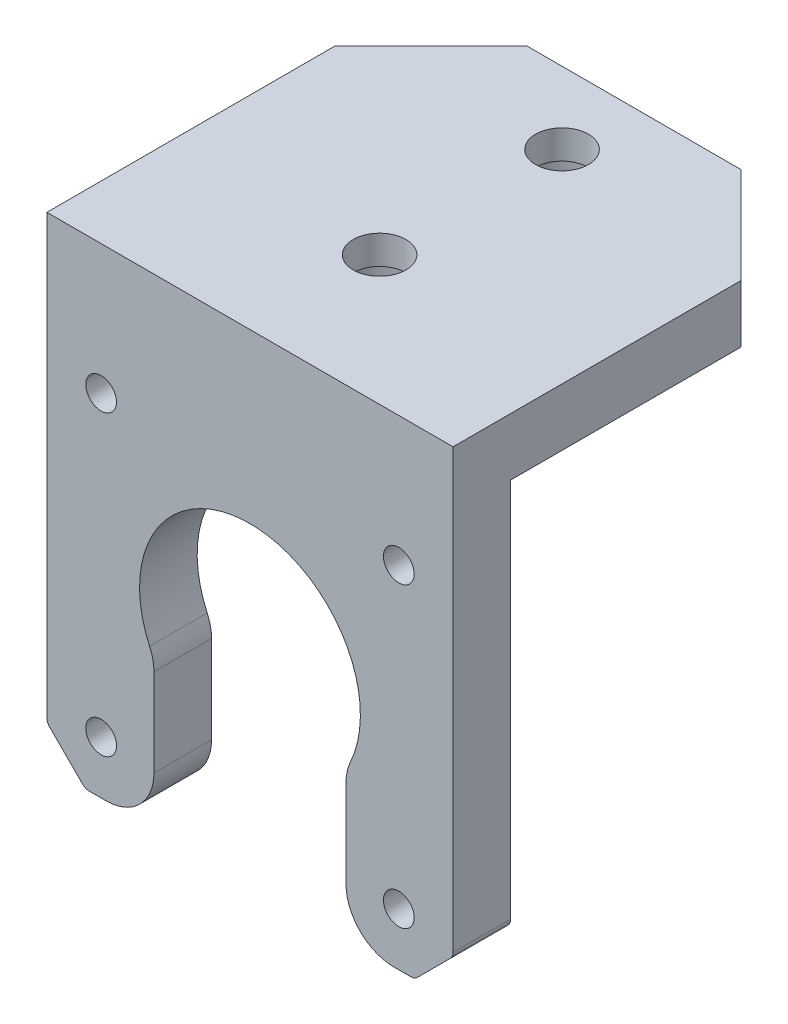
ISO-10303-21;
HEADER;
FILE_DESCRIPTION(('STEP AP214'),'2;1');
FILE_NAME('part.step','',(''),(''),'','','');
FILE_SCHEMA(('AUTOMOTIVE_DESIGN { 1 0 10303 214 1 1 1 1 }'));
ENDSEC;
DATA;
#1=APPLICATION_CONTEXT('core data for automotive mechanical design processes');
#2=APPLICATION_PROTOCOL_DEFINITION('international standard','automotive_design',2000,#1);
#3=PRODUCT_CONTEXT('',#1,'mechanical');
#4=PRODUCT('Part','Part','',(#3));
#5=PRODUCT_RELATED_PRODUCT_CATEGORY('part','',(#4));
#6=PRODUCT_DEFINITION_FORMATION('','',#4);
#7=PRODUCT_DEFINITION_CONTEXT('part definition',#1,'design');
#8=PRODUCT_DEFINITION('design','',#6,#7);
#9=PRODUCT_DEFINITION_SHAPE('','',#8);
#10=(LENGTH_UNIT() NAMED_UNIT(*) SI_UNIT(.MILLI.,.METRE.));
#11=(NAMED_UNIT(*) PLANE_ANGLE_UNIT() SI_UNIT($,.RADIAN.));
#12=(NAMED_UNIT(*) SI_UNIT($,.STERADIAN.) SOLID_ANGLE_UNIT());
#13=UNCERTAINTY_MEASURE_WITH_UNIT(LENGTH_MEASURE(1.E-05),#10,'distance_accuracy_value','');
#14=(GEOMETRIC_REPRESENTATION_CONTEXT(3) GLOBAL_UNCERTAINTY_ASSIGNED_CONTEXT((#13)) GLOBAL_UNIT_ASSIGNED_CONTEXT((#10,
#11,#12)) REPRESENTATION_CONTEXT('',''));
#15=CARTESIAN_POINT('',(0.,0.,0.));
#16=DIRECTION('',(0.,0.,1.));
#17=DIRECTION('',(1.,0.,0.));
#18=AXIS2_PLACEMENT_3D('',#15,#16,#17);
#19=CARTESIAN_POINT('',(-16.7357864376269,-49.,-4.99999999999998));
#20=DIRECTION('',(0.,0.,1.));
#21=DIRECTION('',(1.,0.,0.));
#22=AXIS2_PLACEMENT_3D('',#19,#20,#21);
#23=CYLINDRICAL_SURFACE('',#22,1.);
#24=CARTESIAN_POINT('',(-16.7357864376269,-49.,-5.99999999999998));
#25=DIRECTION('',(0.,0.,1.));
#26=DIRECTION('',(1.,0.,0.));
#27=AXIS2_PLACEMENT_3D('',#24,#25,#26);
#28=CIRCLE('',#27,1.);
#29=CARTESIAN_POINT('',(-17.4428932188135,-49.7071067811866,-5.99999999999998));
#30=VERTEX_POINT('',#29);
#31=CARTESIAN_POINT('',(-16.7357864376269,-50.,-5.99999999999998));
#32=VERTEX_POINT('',#31);
#33=EDGE_CURVE('E170',#30,#32,#28,.T.);
#34=ORIENTED_EDGE('',*,*,#33,.T.);
#35=DIRECTION('',(0.,0.,-1.));
#36=VECTOR('',#35,1.);
#37=CARTESIAN_POINT('',(-16.7357864376269,-50.,0.));
#38=LINE('',#37,#36);
#39=CARTESIAN_POINT('',(-16.7357864376269,-50.,0.));
#40=VERTEX_POINT('',#39);
#41=EDGE_CURVE('E168',#40,#32,#38,.T.);
#42=ORIENTED_EDGE('',*,*,#41,.F.);
#43=CARTESIAN_POINT('',(-16.7357864376269,-49.,0.));
#44=DIRECTION('',(0.,0.,1.));
#45=DIRECTION('',(1.,0.,0.));
#46=AXIS2_PLACEMENT_3D('',#43,#44,#45);
#47=CIRCLE('',#46,1.);
#48=CARTESIAN_POINT('',(-17.4428932188135,-49.7071067811866,0.));
#49=VERTEX_POINT('',#48);
#50=EDGE_CURVE('E19',#40,#49,#47,.F.);
#51=ORIENTED_EDGE('',*,*,#50,.T.);
#52=DIRECTION('',(0.,0.,1.));
#53=VECTOR('',#52,1.);
#54=CARTESIAN_POINT('',(-17.4428932188135,-49.7071067811866,-9.99999999999998));
#55=LINE('',#54,#53);
#56=EDGE_CURVE('E165',#30,#49,#55,.T.);
#57=ORIENTED_EDGE('',*,*,#56,.F.);
#58=EDGE_LOOP('',(#34,#42,#51,#57));
#59=FACE_BOUND('',#58,.T.);
#60=ADVANCED_FACE('F16',(#59),#23,.T.);
#61=CARTESIAN_POINT('',(16.7357864376269,-49.,-4.99999999999998));
#62=DIRECTION('',(0.,0.,-1.));
#63=DIRECTION('',(-1.,0.,0.));
#64=AXIS2_PLACEMENT_3D('',#61,#62,#63);
#65=CYLINDRICAL_SURFACE('',#64,1.);
#66=CARTESIAN_POINT('',(16.7357864376269,-49.,0.));
#67=DIRECTION('',(0.,0.,-1.));
#68=DIRECTION('',(-1.,0.,0.));
#69=AXIS2_PLACEMENT_3D('',#66,#67,#68);
#70=CIRCLE('',#69,1.);
#71=CARTESIAN_POINT('',(17.4428932188135,-49.7071067811866,0.));
#72=VERTEX_POINT('',#71);
#73=CARTESIAN_POINT('',(16.7357864376269,-50.,0.));
#74=VERTEX_POINT('',#73);
#75=EDGE_CURVE('E417',#72,#74,#70,.T.);
#76=ORIENTED_EDGE('',*,*,#75,.T.);
#77=DIRECTION('',(0.,0.,-1.));
#78=VECTOR('',#77,1.);
#79=CARTESIAN_POINT('',(16.7357864376269,-50.,0.));
#80=LINE('',#79,#78);
#81=CARTESIAN_POINT('',(16.7357864376269,-50.,-5.99999999999998));
#82=VERTEX_POINT('',#81);
#83=EDGE_CURVE('E258',#82,#74,#80,.F.);
#84=ORIENTED_EDGE('',*,*,#83,.F.);
#85=CARTESIAN_POINT('',(16.7357864376269,-49.,-5.99999999999998));
#86=DIRECTION('',(0.,0.,-1.));
#87=DIRECTION('',(-1.,0.,0.));
#88=AXIS2_PLACEMENT_3D('',#85,#86,#87);
#89=CIRCLE('',#88,1.);
#90=CARTESIAN_POINT('',(17.4428932188135,-49.7071067811866,-5.99999999999998));
#91=VERTEX_POINT('',#90);
#92=EDGE_CURVE('E419',#82,#91,#89,.F.);
#93=ORIENTED_EDGE('',*,*,#92,.T.);
#94=DIRECTION('',(0.,0.,1.));
#95=VECTOR('',#94,1.);
#96=CARTESIAN_POINT('',(17.4428932188135,-49.7071067811866,-9.99999999999998));
#97=LINE('',#96,#95);
#98=EDGE_CURVE('E252',#72,#91,#97,.F.);
#99=ORIENTED_EDGE('',*,*,#98,.F.);
#100=EDGE_LOOP('',(#76,#84,#93,#99));
#101=FACE_BOUND('',#100,.T.);
#102=ADVANCED_FACE('F589',(#101),#65,.T.);
#103=CARTESIAN_POINT('',(0.,-6.00000000000002,-32.5));
#104=DIRECTION('',(0.,1.,0.));
#105=DIRECTION('',(0.,0.,1.));
#106=AXIS2_PLACEMENT_3D('',#103,#104,#105);
#107=CYLINDRICAL_SURFACE('',#106,4.75);
#108=CARTESIAN_POINT('',(0.,-3.00000000000002,-32.5));
#109=DIRECTION('',(0.,1.,0.));
#110=DIRECTION('',(0.,0.,1.));
#111=AXIS2_PLACEMENT_3D('',#108,#109,#110);
#112=CIRCLE('',#111,4.75);
#113=CARTESIAN_POINT('',(0.,-3.00000000000002,-27.75));
#114=VERTEX_POINT('',#113);
#115=EDGE_CURVE('E382',#114,#114,#112,.F.);
#116=ORIENTED_EDGE('',*,*,#115,.F.);
#117=EDGE_LOOP('',(#116));
#118=FACE_BOUND('',#117,.T.);
#119=CARTESIAN_POINT('',(0.,-6.00000000000002,-32.5));
#120=DIRECTION('',(0.,1.,0.));
#121=DIRECTION('',(0.,0.,1.));
#122=AXIS2_PLACEMENT_3D('',#119,#120,#121);
#123=CIRCLE('',#122,4.75);
#124=CARTESIAN_POINT('',(0.,-6.00000000000002,-27.75));
#125=VERTEX_POINT('',#124);
#126=EDGE_CURVE('E385',#125,#125,#123,.T.);
#127=ORIENTED_EDGE('',*,*,#126,.F.);
#128=EDGE_LOOP('',(#127));
#129=FACE_BOUND('',#128,.T.);
#130=ADVANCED_FACE('F586',(#118,#129),#107,.F.);
#131=CARTESIAN_POINT('',(0.,-6.00000000000001,-13.5));
#132=DIRECTION('',(0.,1.,0.));
#133=DIRECTION('',(0.,0.,1.));
#134=AXIS2_PLACEMENT_3D('',#131,#132,#133);
#135=CYLINDRICAL_SURFACE('',#134,4.75);
#136=CARTESIAN_POINT('',(0.,-3.00000000000001,-13.5));
#137=DIRECTION('',(0.,1.,0.));
#138=DIRECTION('',(0.,0.,1.));
#139=AXIS2_PLACEMENT_3D('',#136,#137,#138);
#140=CIRCLE('',#139,4.75);
#141=CARTESIAN_POINT('',(0.,-3.00000000000001,-8.75));
#142=VERTEX_POINT('',#141);
#143=EDGE_CURVE('E327',#142,#142,#140,.F.);
#144=ORIENTED_EDGE('',*,*,#143,.F.);
#145=EDGE_LOOP('',(#144));
#146=FACE_BOUND('',#145,.T.);
#147=CARTESIAN_POINT('',(0.,-6.00000000000001,-13.5));
#148=DIRECTION('',(0.,1.,0.));
#149=DIRECTION('',(0.,0.,1.));
#150=AXIS2_PLACEMENT_3D('',#147,#148,#149);
#151=CIRCLE('',#150,4.75);
#152=CARTESIAN_POINT('',(0.,-6.00000000000001,-8.75));
#153=VERTEX_POINT('',#152);
#154=EDGE_CURVE('E248',#153,#153,#151,.T.);
#155=ORIENTED_EDGE('',*,*,#154,.F.);
#156=EDGE_LOOP('',(#155));
#157=FACE_BOUND('',#156,.T.);
#158=ADVANCED_FACE('F583',(#146,#157),#135,.F.);
#159=CARTESIAN_POINT('',(-20.15,-45.5857864376269,-15.));
#160=DIRECTION('',(0.,0.,-1.));
#161=DIRECTION('',(-1.,0.,0.));
#162=AXIS2_PLACEMENT_3D('',#159,#160,#161);
#163=CYLINDRICAL_SURFACE('',#162,1.);
#164=CARTESIAN_POINT('',(-20.15,-45.5857864376269,0.));
#165=DIRECTION('',(0.,0.,-1.));
#166=DIRECTION('',(-1.,0.,0.));
#167=AXIS2_PLACEMENT_3D('',#164,#165,#166);
#168=CIRCLE('',#167,1.);
#169=CARTESIAN_POINT('',(-20.8571067811865,-46.2928932188135,0.));
#170=VERTEX_POINT('',#169);
#171=CARTESIAN_POINT('',(-21.15,-45.5857864376269,0.));
#172=VERTEX_POINT('',#171);
#173=EDGE_CURVE('E181',#170,#172,#168,.T.);
#174=ORIENTED_EDGE('',*,*,#173,.T.);
#175=DIRECTION('',(0.,0.,1.));
#176=VECTOR('',#175,1.);
#177=CARTESIAN_POINT('',(-21.15,-45.5857864376269,-20.));
#178=LINE('',#177,#176);
#179=CARTESIAN_POINT('',(-21.15,-45.5857864376269,-5.99999999999999));
#180=VERTEX_POINT('',#179);
#181=EDGE_CURVE('E277',#180,#172,#178,.T.);
#182=ORIENTED_EDGE('',*,*,#181,.F.);
#183=CARTESIAN_POINT('',(-20.15,-45.5857864376269,-5.99999999999998));
#184=DIRECTION('',(0.,0.,-1.));
#185=DIRECTION('',(-1.,0.,0.));
#186=AXIS2_PLACEMENT_3D('',#183,#184,#185);
#187=CIRCLE('',#186,1.);
#188=CARTESIAN_POINT('',(-20.8571067811865,-46.2928932188135,-5.99999999999998));
#189=VERTEX_POINT('',#188);
#190=EDGE_CURVE('E216',#189,#180,#187,.T.);
#191=ORIENTED_EDGE('',*,*,#190,.F.);
#192=DIRECTION('',(0.,0.,1.));
#193=VECTOR('',#192,1.);
#194=CARTESIAN_POINT('',(-20.8571067811865,-46.2928932188135,-9.99999999999998));
#195=LINE('',#194,#193);
#196=EDGE_CURVE('E177',#170,#189,#195,.F.);
#197=ORIENTED_EDGE('',*,*,#196,.F.);
#198=EDGE_LOOP('',(#174,#182,#191,#197));
#199=FACE_BOUND('',#198,.T.);
#200=ADVANCED_FACE('F460',(#199),#163,.T.);
#201=CARTESIAN_POINT('',(-19.15,-48.,-9.99999999999998));
#202=DIRECTION('',(-0.707106781186548,-0.707106781186547,0.));
#203=DIRECTION('',(0.707106781186547,-0.707106781186548,0.));
#204=AXIS2_PLACEMENT_3D('',#201,#202,#203);
#205=PLANE('',#204);
#206=ORIENTED_EDGE('',*,*,#56,.T.);
#207=DIRECTION('',(0.707106781186536,-0.707106781186559,0.));
#208=VECTOR('',#207,1.);
#209=CARTESIAN_POINT('',(-20.8571067811865,-46.2928932188135,0.));
#210=LINE('',#209,#208);
#211=EDGE_CURVE('E174',#170,#49,#210,.T.);
#212=ORIENTED_EDGE('',*,*,#211,.F.);
#213=ORIENTED_EDGE('',*,*,#196,.T.);
#214=DIRECTION('',(-0.707106781186536,0.707106781186559,0.));
#215=VECTOR('',#214,1.);
#216=CARTESIAN_POINT('',(-17.4428932188135,-49.7071067811866,-5.99999999999998));
#217=LINE('',#216,#215);
#218=EDGE_CURVE('E176',#30,#189,#217,.T.);
#219=ORIENTED_EDGE('',*,*,#218,.F.);
#220=EDGE_LOOP('',(#206,#212,#213,#219));
#221=FACE_BOUND('',#220,.T.);
#222=ADVANCED_FACE('F173',(#221),#205,.T.);
#223=CARTESIAN_POINT('',(0.,-50.,0.));
#224=DIRECTION('',(0.,-1.,0.));
#225=DIRECTION('',(0.,0.,-1.));
#226=AXIS2_PLACEMENT_3D('',#223,#224,#225);
#227=PLANE('',#226);
#228=DIRECTION('',(0.,0.,1.));
#229=VECTOR('',#228,1.);
#230=CARTESIAN_POINT('',(-15.,-50.,-2.99999999999998));
#231=LINE('',#230,#229);
#232=CARTESIAN_POINT('',(-15.,-50.,0.));
#233=VERTEX_POINT('',#232);
#234=CARTESIAN_POINT('',(-15.,-50.,-5.99999999999998));
#235=VERTEX_POINT('',#234);
#236=EDGE_CURVE('E273',#233,#235,#231,.F.);
#237=ORIENTED_EDGE('',*,*,#236,.F.);
#238=DIRECTION('',(1.,0.,0.));
#239=VECTOR('',#238,1.);
#240=CARTESIAN_POINT('',(0.,-50.,0.));
#241=LINE('',#240,#239);
#242=EDGE_CURVE('E183',#40,#233,#241,.T.);
#243=ORIENTED_EDGE('',*,*,#242,.F.);
#244=ORIENTED_EDGE('',*,*,#41,.T.);
#245=DIRECTION('',(1.,0.,0.));
#246=VECTOR('',#245,1.);
#247=CARTESIAN_POINT('',(0.,-50.,-5.99999999999998));
#248=LINE('',#247,#246);
#249=EDGE_CURVE('E217',#235,#32,#248,.F.);
#250=ORIENTED_EDGE('',*,*,#249,.F.);
#251=EDGE_LOOP('',(#237,#243,#244,#250));
#252=FACE_BOUND('',#251,.T.);
#253=ADVANCED_FACE('F423',(#252),#227,.T.);
#254=CARTESIAN_POINT('',(-15.,-45.,-2.99999999999998));
#255=DIRECTION('',(0.,0.,1.));
#256=DIRECTION('',(1.,0.,0.));
#257=AXIS2_PLACEMENT_3D('',#254,#255,#256);
#258=CYLINDRICAL_SURFACE('',#257,5.);
#259=CARTESIAN_POINT('',(-15.,-45.,-5.99999999999998));
#260=DIRECTION('',(0.,0.,1.));
#261=DIRECTION('',(1.,0.,0.));
#262=AXIS2_PLACEMENT_3D('',#259,#260,#261);
#263=CIRCLE('',#262,5.);
#264=CARTESIAN_POINT('',(-10.,-45.,-5.99999999999998));
#265=VERTEX_POINT('',#264);
#266=EDGE_CURVE('E220',#265,#235,#263,.F.);
#267=ORIENTED_EDGE('',*,*,#266,.F.);
#268=DIRECTION('',(0.,0.,1.));
#269=VECTOR('',#268,1.);
#270=CARTESIAN_POINT('',(-10.,-45.,-5.99999999999999));
#271=LINE('',#270,#269);
#272=CARTESIAN_POINT('',(-10.,-45.,0.));
#273=VERTEX_POINT('',#272);
#274=EDGE_CURVE('E271',#265,#273,#271,.T.);
#275=ORIENTED_EDGE('',*,*,#274,.T.);
#276=CARTESIAN_POINT('',(-15.,-45.,0.));
#277=DIRECTION('',(0.,0.,1.));
#278=DIRECTION('',(1.,0.,0.));
#279=AXIS2_PLACEMENT_3D('',#276,#277,#278);
#280=CIRCLE('',#279,5.);
#281=EDGE_CURVE('E186',#233,#273,#280,.T.);
#282=ORIENTED_EDGE('',*,*,#281,.F.);
#283=ORIENTED_EDGE('',*,*,#236,.T.);
#284=EDGE_LOOP('',(#267,#275,#282,#283));
#285=FACE_BOUND('',#284,.T.);
#286=ADVANCED_FACE('F428',(#285),#258,.T.);
#287=CARTESIAN_POINT('',(-10.,-34.6789083458002,-5.99999999999999));
#288=DIRECTION('',(-1.,0.,0.));
#289=DIRECTION('',(0.,0.,1.));
#290=AXIS2_PLACEMENT_3D('',#287,#288,#289);
#291=PLANE('',#290);
#292=DIRECTION('',(0.,1.,0.));
#293=VECTOR('',#292,1.);
#294=CARTESIAN_POINT('',(-10.,-50.,-5.99999999999998));
#295=LINE('',#294,#293);
#296=CARTESIAN_POINT('',(-10.,-35.8738635424337,-5.99999999999999));
#297=VERTEX_POINT('',#296);
#298=EDGE_CURVE('E221',#297,#265,#295,.F.);
#299=ORIENTED_EDGE('',*,*,#298,.F.);
#300=DIRECTION('',(0.,0.,1.));
#301=VECTOR('',#300,1.);
#302=CARTESIAN_POINT('',(-10.0000000000001,-35.8738635424337,-5.99999999999998));
#303=LINE('',#302,#301);
#304=CARTESIAN_POINT('',(-10.,-35.8738635424337,0.));
#305=VERTEX_POINT('',#304);
#306=EDGE_CURVE('E269',#305,#297,#303,.F.);
#307=ORIENTED_EDGE('',*,*,#306,.F.);
#308=DIRECTION('',(0.,-1.,0.));
#309=VECTOR('',#308,1.);
#310=CARTESIAN_POINT('',(-10.,0.,0.));
#311=LINE('',#310,#309);
#312=EDGE_CURVE('E376',#273,#305,#311,.F.);
#313=ORIENTED_EDGE('',*,*,#312,.F.);
#314=ORIENTED_EDGE('',*,*,#274,.F.);
#315=EDGE_LOOP('',(#299,#307,#313,#314));
#316=FACE_BOUND('',#315,.T.);
#317=ADVANCED_FACE('F571',(#316),#291,.F.);
#318=CARTESIAN_POINT('',(-15.0000000000001,-35.8738635424337,-5.99999999999998));
#319=DIRECTION('',(0.,0.,1.));
#320=DIRECTION('',(0.,-1.,0.));
#321=AXIS2_PLACEMENT_3D('',#318,#319,#320);
#322=CYLINDRICAL_SURFACE('',#321,5.);
#323=CARTESIAN_POINT('',(-15.0000000000001,-35.8738635424337,-5.99999999999999));
#324=DIRECTION('',(0.,0.,1.));
#325=DIRECTION('',(0.,-1.,0.));
#326=AXIS2_PLACEMENT_3D('',#323,#324,#325);
#327=CIRCLE('',#326,5.);
#328=CARTESIAN_POINT('',(-10.4545454545455,-33.7908745901811,-5.99999999999999));
#329=VERTEX_POINT('',#328);
#330=EDGE_CURVE('E224',#329,#297,#327,.F.);
#331=ORIENTED_EDGE('',*,*,#330,.F.);
#332=DIRECTION('',(0.,0.,1.));
#333=VECTOR('',#332,1.);
#334=CARTESIAN_POINT('',(-10.4545454545455,-33.7908745901811,-5.99999999999999));
#335=LINE('',#334,#333);
#336=CARTESIAN_POINT('',(-10.4545454545455,-33.7908745901811,0.));
#337=VERTEX_POINT('',#336);
#338=EDGE_CURVE('E267',#329,#337,#335,.T.);
#339=ORIENTED_EDGE('',*,*,#338,.T.);
#340=CARTESIAN_POINT('',(-15.0000000000001,-35.8738635424337,0.));
#341=DIRECTION('',(0.,0.,1.));
#342=DIRECTION('',(0.,-1.,0.));
#343=AXIS2_PLACEMENT_3D('',#340,#341,#342);
#344=CIRCLE('',#343,5.);
#345=EDGE_CURVE('E373',#305,#337,#344,.T.);
#346=ORIENTED_EDGE('',*,*,#345,.F.);
#347=ORIENTED_EDGE('',*,*,#306,.T.);
#348=EDGE_LOOP('',(#331,#339,#346,#347));
#349=FACE_BOUND('',#348,.T.);
#350=ADVANCED_FACE('F567',(#349),#322,.T.);
#351=CARTESIAN_POINT('',(0.,-29.,-5.99999999999999));
#352=DIRECTION('',(0.,0.,1.));
#353=DIRECTION('',(0.,-1.,0.));
#354=AXIS2_PLACEMENT_3D('',#351,#352,#353);
#355=CYLINDRICAL_SURFACE('',#354,11.5);
#356=CARTESIAN_POINT('',(0.,-29.,-5.99999999999999));
#357=DIRECTION('',(0.,0.,1.));
#358=DIRECTION('',(0.,-1.,0.));
#359=AXIS2_PLACEMENT_3D('',#356,#357,#358);
#360=CIRCLE('',#359,11.5);
#361=CARTESIAN_POINT('',(10.4545454545454,-33.7908745901812,-5.99999999999999));
#362=VERTEX_POINT('',#361);
#363=EDGE_CURVE('E407',#362,#329,#360,.T.);
#364=ORIENTED_EDGE('',*,*,#363,.F.);
#365=DIRECTION('',(0.,0.,1.));
#366=VECTOR('',#365,1.);
#367=CARTESIAN_POINT('',(10.4545454545455,-33.7908745901812,-5.99999999999998));
#368=LINE('',#367,#366);
#369=CARTESIAN_POINT('',(10.4545454545455,-33.7908745901812,0.));
#370=VERTEX_POINT('',#369);
#371=EDGE_CURVE('E265',#370,#362,#368,.F.);
#372=ORIENTED_EDGE('',*,*,#371,.F.);
#373=CARTESIAN_POINT('',(0.,-29.,0.));
#374=DIRECTION('',(0.,0.,1.));
#375=DIRECTION('',(0.,-1.,0.));
#376=AXIS2_PLACEMENT_3D('',#373,#374,#375);
#377=CIRCLE('',#376,11.5);
#378=EDGE_CURVE('E370',#337,#370,#377,.F.);
#379=ORIENTED_EDGE('',*,*,#378,.F.);
#380=ORIENTED_EDGE('',*,*,#338,.F.);
#381=EDGE_LOOP('',(#364,#372,#379,#380));
#382=FACE_BOUND('',#381,.T.);
#383=ADVANCED_FACE('F563',(#382),#355,.F.);
#384=CARTESIAN_POINT('',(15.,-35.8738635424339,-5.99999999999998));
#385=DIRECTION('',(0.,0.,1.));
#386=DIRECTION('',(0.,-1.,0.));
#387=AXIS2_PLACEMENT_3D('',#384,#385,#386);
#388=CYLINDRICAL_SURFACE('',#387,5.);
#389=CARTESIAN_POINT('',(15.,-35.8738635424339,-5.99999999999999));
#390=DIRECTION('',(0.,0.,1.));
#391=DIRECTION('',(0.,-1.,0.));
#392=AXIS2_PLACEMENT_3D('',#389,#390,#391);
#393=CIRCLE('',#392,5.);
#394=CARTESIAN_POINT('',(9.99999999999997,-35.8738635424339,-5.99999999999999));
#395=VERTEX_POINT('',#394);
#396=EDGE_CURVE('E228',#395,#362,#393,.F.);
#397=ORIENTED_EDGE('',*,*,#396,.F.);
#398=DIRECTION('',(0.,0.,-1.));
#399=VECTOR('',#398,1.);
#400=CARTESIAN_POINT('',(9.99999999999997,-35.8738635424339,-5.99999999999998));
#401=LINE('',#400,#399);
#402=CARTESIAN_POINT('',(9.99999999999997,-35.8738635424339,0.));
#403=VERTEX_POINT('',#402);
#404=EDGE_CURVE('E263',#395,#403,#401,.F.);
#405=ORIENTED_EDGE('',*,*,#404,.T.);
#406=CARTESIAN_POINT('',(15.,-35.8738635424339,0.));
#407=DIRECTION('',(0.,0.,1.));
#408=DIRECTION('',(0.,-1.,0.));
#409=AXIS2_PLACEMENT_3D('',#406,#407,#408);
#410=CIRCLE('',#409,5.);
#411=EDGE_CURVE('E367',#370,#403,#410,.T.);
#412=ORIENTED_EDGE('',*,*,#411,.F.);
#413=ORIENTED_EDGE('',*,*,#371,.T.);
#414=EDGE_LOOP('',(#397,#405,#412,#413));
#415=FACE_BOUND('',#414,.T.);
#416=ADVANCED_FACE('F559',(#415),#388,.T.);
#417=CARTESIAN_POINT('',(9.99999999999997,-50.,-5.99999999999998));
#418=DIRECTION('',(1.,0.,0.));
#419=DIRECTION('',(0.,0.,-1.));
#420=AXIS2_PLACEMENT_3D('',#417,#418,#419);
#421=PLANE('',#420);
#422=DIRECTION('',(0.,1.,0.));
#423=VECTOR('',#422,1.);
#424=CARTESIAN_POINT('',(9.99999999999997,-50.,-5.99999999999998));
#425=LINE('',#424,#423);
#426=CARTESIAN_POINT('',(9.99999999999998,-45.,-5.99999999999998));
#427=VERTEX_POINT('',#426);
#428=EDGE_CURVE('E225',#427,#395,#425,.T.);
#429=ORIENTED_EDGE('',*,*,#428,.F.);
#430=DIRECTION('',(0.,0.,-1.));
#431=VECTOR('',#430,1.);
#432=CARTESIAN_POINT('',(10.,-45.,-2.99999999999998));
#433=LINE('',#432,#431);
#434=CARTESIAN_POINT('',(9.99999999999998,-45.,0.));
#435=VERTEX_POINT('',#434);
#436=EDGE_CURVE('E261',#435,#427,#433,.T.);
#437=ORIENTED_EDGE('',*,*,#436,.F.);
#438=DIRECTION('',(0.,-1.,0.));
#439=VECTOR('',#438,1.);
#440=CARTESIAN_POINT('',(9.99999999999997,0.,0.));
#441=LINE('',#440,#439);
#442=EDGE_CURVE('E366',#403,#435,#441,.T.);
#443=ORIENTED_EDGE('',*,*,#442,.F.);
#444=ORIENTED_EDGE('',*,*,#404,.F.);
#445=EDGE_LOOP('',(#429,#437,#443,#444));
#446=FACE_BOUND('',#445,.T.);
#447=ADVANCED_FACE('F555',(#446),#421,.F.);
#448=CARTESIAN_POINT('',(15.,-45.,-2.99999999999998));
#449=DIRECTION('',(0.,0.,-1.));
#450=DIRECTION('',(-1.,0.,0.));
#451=AXIS2_PLACEMENT_3D('',#448,#449,#450);
#452=CYLINDRICAL_SURFACE('',#451,5.);
#453=CARTESIAN_POINT('',(15.,-45.,0.));
#454=DIRECTION('',(0.,0.,-1.));
#455=DIRECTION('',(-1.,0.,0.));
#456=AXIS2_PLACEMENT_3D('',#453,#454,#455);
#457=CIRCLE('',#456,5.);
#458=CARTESIAN_POINT('',(15.,-50.,0.));
#459=VERTEX_POINT('',#458);
#460=EDGE_CURVE('E362',#435,#459,#457,.F.);
#461=ORIENTED_EDGE('',*,*,#460,.F.);
#462=ORIENTED_EDGE('',*,*,#436,.T.);
#463=CARTESIAN_POINT('',(15.,-45.,-5.99999999999998));
#464=DIRECTION('',(0.,0.,-1.));
#465=DIRECTION('',(-1.,0.,0.));
#466=AXIS2_PLACEMENT_3D('',#463,#464,#465);
#467=CIRCLE('',#466,5.);
#468=CARTESIAN_POINT('',(15.,-50.,-5.99999999999998));
#469=VERTEX_POINT('',#468);
#470=EDGE_CURVE('E229',#469,#427,#467,.T.);
#471=ORIENTED_EDGE('',*,*,#470,.F.);
#472=DIRECTION('',(0.,0.,-1.));
#473=VECTOR('',#472,1.);
#474=CARTESIAN_POINT('',(15.,-50.,0.));
#475=LINE('',#474,#473);
#476=EDGE_CURVE('E256',#459,#469,#475,.T.);
#477=ORIENTED_EDGE('',*,*,#476,.F.);
#478=EDGE_LOOP('',(#461,#462,#471,#477));
#479=FACE_BOUND('',#478,.T.);
#480=ADVANCED_FACE('F551',(#479),#452,.T.);
#481=CARTESIAN_POINT('',(0.,-50.,0.));
#482=DIRECTION('',(0.,-1.,0.));
#483=DIRECTION('',(0.,0.,-1.));
#484=AXIS2_PLACEMENT_3D('',#481,#482,#483);
#485=PLANE('',#484);
#486=ORIENTED_EDGE('',*,*,#476,.T.);
#487=DIRECTION('',(1.,0.,0.));
#488=VECTOR('',#487,1.);
#489=CARTESIAN_POINT('',(0.,-50.,-5.99999999999998));
#490=LINE('',#489,#488);
#491=EDGE_CURVE('E230',#82,#469,#490,.F.);
#492=ORIENTED_EDGE('',*,*,#491,.F.);
#493=ORIENTED_EDGE('',*,*,#83,.T.);
#494=DIRECTION('',(1.,0.,0.));
#495=VECTOR('',#494,1.);
#496=CARTESIAN_POINT('',(0.,-50.,0.));
#497=LINE('',#496,#495);
#498=EDGE_CURVE('E365',#459,#74,#497,.T.);
#499=ORIENTED_EDGE('',*,*,#498,.F.);
#500=EDGE_LOOP('',(#486,#492,#493,#499));
#501=FACE_BOUND('',#500,.T.);
#502=ADVANCED_FACE('F548',(#501),#485,.T.);
#503=CARTESIAN_POINT('',(19.15,-48.,-9.99999999999998));
#504=DIRECTION('',(0.707106781186548,-0.707106781186547,0.));
#505=DIRECTION('',(0.707106781186547,0.707106781186548,0.));
#506=AXIS2_PLACEMENT_3D('',#503,#504,#505);
#507=PLANE('',#506);
#508=ORIENTED_EDGE('',*,*,#98,.T.);
#509=DIRECTION('',(-0.707106781186536,-0.707106781186559,0.));
#510=VECTOR('',#509,1.);
#511=CARTESIAN_POINT('',(20.8571067811865,-46.2928932188135,-5.99999999999998));
#512=LINE('',#511,#510);
#513=CARTESIAN_POINT('',(20.8571067811865,-46.2928932188135,-5.99999999999998));
#514=VERTEX_POINT('',#513);
#515=EDGE_CURVE('E233',#514,#91,#512,.T.);
#516=ORIENTED_EDGE('',*,*,#515,.F.);
#517=DIRECTION('',(0.,0.,1.));
#518=VECTOR('',#517,1.);
#519=CARTESIAN_POINT('',(20.8571067811865,-46.2928932188135,-15.));
#520=LINE('',#519,#518);
#521=CARTESIAN_POINT('',(20.8571067811865,-46.2928932188135,0.));
#522=VERTEX_POINT('',#521);
#523=EDGE_CURVE('E255',#522,#514,#520,.F.);
#524=ORIENTED_EDGE('',*,*,#523,.F.);
#525=DIRECTION('',(0.707106781186536,0.707106781186559,0.));
#526=VECTOR('',#525,1.);
#527=CARTESIAN_POINT('',(17.4428932188135,-49.7071067811866,0.));
#528=LINE('',#527,#526);
#529=EDGE_CURVE('E361',#72,#522,#528,.T.);
#530=ORIENTED_EDGE('',*,*,#529,.F.);
#531=EDGE_LOOP('',(#508,#516,#524,#530));
#532=FACE_BOUND('',#531,.T.);
#533=ADVANCED_FACE('F444',(#532),#507,.T.);
#534=CARTESIAN_POINT('',(-15.5,-44.5,-5.99999999999998));
#535=DIRECTION('',(0.,0.,1.));
#536=DIRECTION('',(1.,0.,0.));
#537=AXIS2_PLACEMENT_3D('',#534,#535,#536);
#538=CYLINDRICAL_SURFACE('',#537,1.6);
#539=CARTESIAN_POINT('',(-15.5,-44.5,0.));
#540=DIRECTION('',(0.,0.,1.));
#541=DIRECTION('',(1.,0.,0.));
#542=AXIS2_PLACEMENT_3D('',#539,#540,#541);
#543=CIRCLE('',#542,1.6);
#544=CARTESIAN_POINT('',(-13.9,-44.5,0.));
#545=VERTEX_POINT('',#544);
#546=EDGE_CURVE('E358',#545,#545,#543,.F.);
#547=ORIENTED_EDGE('',*,*,#546,.F.);
#548=EDGE_LOOP('',(#547));
#549=FACE_BOUND('',#548,.T.);
#550=CARTESIAN_POINT('',(-15.5,-44.5,-5.99999999999998));
#551=DIRECTION('',(0.,0.,1.));
#552=DIRECTION('',(1.,0.,0.));
#553=AXIS2_PLACEMENT_3D('',#550,#551,#552);
#554=CIRCLE('',#553,1.6);
#555=CARTESIAN_POINT('',(-13.9,-44.5,-5.99999999999998));
#556=VERTEX_POINT('',#555);
#557=EDGE_CURVE('E249',#556,#556,#554,.T.);
#558=ORIENTED_EDGE('',*,*,#557,.F.);
#559=EDGE_LOOP('',(#558));
#560=FACE_BOUND('',#559,.T.);
#561=ADVANCED_FACE('F514',(#549,#560),#538,.F.);
#562=CARTESIAN_POINT('',(15.5,-44.5,-5.99999999999998));
#563=DIRECTION('',(0.,0.,1.));
#564=DIRECTION('',(1.,0.,0.));
#565=AXIS2_PLACEMENT_3D('',#562,#563,#564);
#566=CYLINDRICAL_SURFACE('',#565,1.6);
#567=CARTESIAN_POINT('',(15.5,-44.5,0.));
#568=DIRECTION('',(0.,0.,1.));
#569=DIRECTION('',(1.,0.,0.));
#570=AXIS2_PLACEMENT_3D('',#567,#568,#569);
#571=CIRCLE('',#570,1.6);
#572=CARTESIAN_POINT('',(17.1,-44.5,0.));
#573=VERTEX_POINT('',#572);
#574=EDGE_CURVE('E355',#573,#573,#571,.F.);
#575=ORIENTED_EDGE('',*,*,#574,.F.);
#576=EDGE_LOOP('',(#575));
#577=FACE_BOUND('',#576,.T.);
#578=CARTESIAN_POINT('',(15.5,-44.5,-5.99999999999998));
#579=DIRECTION('',(0.,0.,1.));
#580=DIRECTION('',(1.,0.,0.));
#581=AXIS2_PLACEMENT_3D('',#578,#579,#580);
#582=CIRCLE('',#581,1.6);
#583=CARTESIAN_POINT('',(17.1,-44.5,-5.99999999999998));
#584=VERTEX_POINT('',#583);
#585=EDGE_CURVE('E392',#584,#584,#582,.T.);
#586=ORIENTED_EDGE('',*,*,#585,.F.);
#587=EDGE_LOOP('',(#586));
#588=FACE_BOUND('',#587,.T.);
#589=ADVANCED_FACE('F517',(#577,#588),#566,.F.);
#590=CARTESIAN_POINT('',(-15.5,-13.5,-6.));
#591=DIRECTION('',(0.,0.,1.));
#592=DIRECTION('',(0.,-1.,0.));
#593=AXIS2_PLACEMENT_3D('',#590,#591,#592);
#594=CYLINDRICAL_SURFACE('',#593,1.6);
#595=CARTESIAN_POINT('',(-15.5,-13.5,0.));
#596=DIRECTION('',(0.,0.,1.));
#597=DIRECTION('',(0.,-1.,0.));
#598=AXIS2_PLACEMENT_3D('',#595,#596,#597);
#599=CIRCLE('',#598,1.6);
#600=CARTESIAN_POINT('',(-15.5,-15.1,0.));
#601=VERTEX_POINT('',#600);
#602=EDGE_CURVE('E352',#601,#601,#599,.F.);
#603=ORIENTED_EDGE('',*,*,#602,.F.);
#604=EDGE_LOOP('',(#603));
#605=FACE_BOUND('',#604,.T.);
#606=CARTESIAN_POINT('',(-15.5,-13.5,-6.));
#607=DIRECTION('',(0.,0.,1.));
#608=DIRECTION('',(0.,-1.,0.));
#609=AXIS2_PLACEMENT_3D('',#606,#607,#608);
#610=CIRCLE('',#609,1.6);
#611=CARTESIAN_POINT('',(-15.5,-15.1,-6.));
#612=VERTEX_POINT('',#611);
#613=EDGE_CURVE('E395',#612,#612,#610,.T.);
#614=ORIENTED_EDGE('',*,*,#613,.F.);
#615=EDGE_LOOP('',(#614));
#616=FACE_BOUND('',#615,.T.);
#617=ADVANCED_FACE('F532',(#605,#616),#594,.F.);
#618=CARTESIAN_POINT('',(15.5,-13.5,-6.));
#619=DIRECTION('',(0.,0.,1.));
#620=DIRECTION('',(0.,-1.,0.));
#621=AXIS2_PLACEMENT_3D('',#618,#619,#620);
#622=CYLINDRICAL_SURFACE('',#621,1.6);
#623=CARTESIAN_POINT('',(15.5,-13.5,0.));
#624=DIRECTION('',(0.,0.,1.));
#625=DIRECTION('',(0.,-1.,0.));
#626=AXIS2_PLACEMENT_3D('',#623,#624,#625);
#627=CIRCLE('',#626,1.6);
#628=CARTESIAN_POINT('',(15.5,-15.1,0.));
#629=VERTEX_POINT('',#628);
#630=EDGE_CURVE('E198',#629,#629,#627,.F.);
#631=ORIENTED_EDGE('',*,*,#630,.F.);
#632=EDGE_LOOP('',(#631));
#633=FACE_BOUND('',#632,.T.);
#634=CARTESIAN_POINT('',(15.5,-13.5,-6.));
#635=DIRECTION('',(0.,0.,1.));
#636=DIRECTION('',(0.,-1.,0.));
#637=AXIS2_PLACEMENT_3D('',#634,#635,#636);
#638=CIRCLE('',#637,1.6);
#639=CARTESIAN_POINT('',(15.5,-15.1,-6.));
#640=VERTEX_POINT('',#639);
#641=EDGE_CURVE('E398',#640,#640,#638,.T.);
#642=ORIENTED_EDGE('',*,*,#641,.F.);
#643=EDGE_LOOP('',(#642));
#644=FACE_BOUND('',#643,.T.);
#645=ADVANCED_FACE('F530',(#633,#644),#622,.F.);
#646=CARTESIAN_POINT('',(20.15,-45.5857864376269,-15.));
#647=DIRECTION('',(0.,0.,1.));
#648=DIRECTION('',(1.,0.,0.));
#649=AXIS2_PLACEMENT_3D('',#646,#647,#648);
#650=CYLINDRICAL_SURFACE('',#649,1.);
#651=CARTESIAN_POINT('',(20.15,-45.5857864376269,-5.99999999999998));
#652=DIRECTION('',(0.,0.,1.));
#653=DIRECTION('',(1.,0.,0.));
#654=AXIS2_PLACEMENT_3D('',#651,#652,#653);
#655=CIRCLE('',#654,1.);
#656=CARTESIAN_POINT('',(21.15,-45.5857864376269,-5.99999999999998));
#657=VERTEX_POINT('',#656);
#658=EDGE_CURVE('E236',#657,#514,#655,.F.);
#659=ORIENTED_EDGE('',*,*,#658,.F.);
#660=DIRECTION('',(0.,0.,-1.));
#661=VECTOR('',#660,1.);
#662=CARTESIAN_POINT('',(21.15,-45.5857864376269,-20.));
#663=LINE('',#662,#661);
#664=CARTESIAN_POINT('',(21.15,-45.5857864376269,0.));
#665=VERTEX_POINT('',#664);
#666=EDGE_CURVE('E194',#665,#657,#663,.T.);
#667=ORIENTED_EDGE('',*,*,#666,.F.);
#668=CARTESIAN_POINT('',(20.15,-45.5857864376269,0.));
#669=DIRECTION('',(0.,0.,1.));
#670=DIRECTION('',(1.,0.,0.));
#671=AXIS2_PLACEMENT_3D('',#668,#669,#670);
#672=CIRCLE('',#671,1.);
#673=EDGE_CURVE('E188',#522,#665,#672,.T.);
#674=ORIENTED_EDGE('',*,*,#673,.F.);
#675=ORIENTED_EDGE('',*,*,#523,.T.);
#676=EDGE_LOOP('',(#659,#667,#674,#675));
#677=FACE_BOUND('',#676,.T.);
#678=ADVANCED_FACE('F447',(#677),#650,.T.);
#679=CARTESIAN_POINT('',(0.,-50.,-5.99999999999998));
#680=DIRECTION('',(0.,0.,-1.));
#681=DIRECTION('',(0.,1.,0.));
#682=AXIS2_PLACEMENT_3D('',#679,#680,#681);
#683=PLANE('',#682);
#684=ORIENTED_EDGE('',*,*,#557,.T.);
#685=EDGE_LOOP('',(#684));
#686=FACE_BOUND('',#685,.T.);
#687=ORIENTED_EDGE('',*,*,#585,.T.);
#688=EDGE_LOOP('',(#687));
#689=FACE_BOUND('',#688,.T.);
#690=ORIENTED_EDGE('',*,*,#613,.T.);
#691=EDGE_LOOP('',(#690));
#692=FACE_BOUND('',#691,.T.);
#693=ORIENTED_EDGE('',*,*,#641,.T.);
#694=EDGE_LOOP('',(#693));
#695=FACE_BOUND('',#694,.T.);
#696=DIRECTION('',(1.,0.,0.));
#697=VECTOR('',#696,1.);
#698=CARTESIAN_POINT('',(0.,-6.00000000000001,-6.));
#699=LINE('',#698,#697);
#700=CARTESIAN_POINT('',(21.15,-6.00000000000001,-5.99999999999999));
#701=VERTEX_POINT('',#700);
#702=CARTESIAN_POINT('',(-21.15,-6.00000000000002,-6.));
#703=VERTEX_POINT('',#702);
#704=EDGE_CURVE('E246',#701,#703,#699,.F.);
#705=ORIENTED_EDGE('',*,*,#704,.F.);
#706=DIRECTION('',(0.,1.,0.));
#707=VECTOR('',#706,1.);
#708=CARTESIAN_POINT('',(21.15,-25.,-5.99999999999998));
#709=LINE('',#708,#707);
#710=EDGE_CURVE('E197',#657,#701,#709,.T.);
#711=ORIENTED_EDGE('',*,*,#710,.F.);
#712=ORIENTED_EDGE('',*,*,#658,.T.);
#713=ORIENTED_EDGE('',*,*,#515,.T.);
#714=ORIENTED_EDGE('',*,*,#92,.F.);
#715=ORIENTED_EDGE('',*,*,#491,.T.);
#716=ORIENTED_EDGE('',*,*,#470,.T.);
#717=ORIENTED_EDGE('',*,*,#428,.T.);
#718=ORIENTED_EDGE('',*,*,#396,.T.);
#719=ORIENTED_EDGE('',*,*,#363,.T.);
#720=ORIENTED_EDGE('',*,*,#330,.T.);
#721=ORIENTED_EDGE('',*,*,#298,.T.);
#722=ORIENTED_EDGE('',*,*,#266,.T.);
#723=ORIENTED_EDGE('',*,*,#249,.T.);
#724=ORIENTED_EDGE('',*,*,#33,.F.);
#725=ORIENTED_EDGE('',*,*,#218,.T.);
#726=ORIENTED_EDGE('',*,*,#190,.T.);
#727=DIRECTION('',(0.,1.,0.));
#728=VECTOR('',#727,1.);
#729=CARTESIAN_POINT('',(-21.15,-25.,-6.));
#730=LINE('',#729,#728);
#731=EDGE_CURVE('E288',#703,#180,#730,.F.);
#732=ORIENTED_EDGE('',*,*,#731,.F.);
#733=EDGE_LOOP('',(#705,#711,#712,#713,#714,#715,#716,#717,#718,#719,#720,#721,#722,#723,#724,
#725,#726,#732));
#734=FACE_BOUND('',#733,.T.);
#735=ADVANCED_FACE('F424',(#686,#689,#692,#695,#734),#683,.T.);
#736=CARTESIAN_POINT('',(0.,-6.00000000000001,-6.));
#737=DIRECTION('',(0.,-1.,0.));
#738=DIRECTION('',(0.,0.,-1.));
#739=AXIS2_PLACEMENT_3D('',#736,#737,#738);
#740=PLANE('',#739);
#741=ORIENTED_EDGE('',*,*,#126,.T.);
#742=EDGE_LOOP('',(#741));
#743=FACE_BOUND('',#742,.T.);
#744=ORIENTED_EDGE('',*,*,#154,.T.);
#745=EDGE_LOOP('',(#744));
#746=FACE_BOUND('',#745,.T.);
#747=DIRECTION('',(-0.707106781186548,0.,0.707106781186548));
#748=VECTOR('',#747,1.);
#749=CARTESIAN_POINT('',(-16.15,-6.00000000000002,-35.));
#750=LINE('',#749,#748);
#751=CARTESIAN_POINT('',(-11.15,-6.00000000000002,-40.));
#752=VERTEX_POINT('',#751);
#753=CARTESIAN_POINT('',(-21.15,-6.00000000000002,-30.));
#754=VERTEX_POINT('',#753);
#755=EDGE_CURVE('E302',#752,#754,#750,.T.);
#756=ORIENTED_EDGE('',*,*,#755,.F.);
#757=DIRECTION('',(-1.,0.,0.));
#758=VECTOR('',#757,1.);
#759=CARTESIAN_POINT('',(0.,-6.00000000000002,-40.));
#760=LINE('',#759,#758);
#761=CARTESIAN_POINT('',(11.15,-6.00000000000002,-40.));
#762=VERTEX_POINT('',#761);
#763=EDGE_CURVE('E304',#762,#752,#760,.T.);
#764=ORIENTED_EDGE('',*,*,#763,.F.);
#765=DIRECTION('',(-0.707106781186548,0.,-0.707106781186548));
#766=VECTOR('',#765,1.);
#767=CARTESIAN_POINT('',(16.15,-6.00000000000002,-35.));
#768=LINE('',#767,#766);
#769=CARTESIAN_POINT('',(21.15,-6.00000000000001,-30.));
#770=VERTEX_POINT('',#769);
#771=EDGE_CURVE('E323',#770,#762,#768,.T.);
#772=ORIENTED_EDGE('',*,*,#771,.F.);
#773=DIRECTION('',(0.,0.,-1.));
#774=VECTOR('',#773,1.);
#775=CARTESIAN_POINT('',(21.15,-6.00000000000001,-20.));
#776=LINE('',#775,#774);
#777=EDGE_CURVE('E239',#701,#770,#776,.T.);
#778=ORIENTED_EDGE('',*,*,#777,.F.);
#779=ORIENTED_EDGE('',*,*,#704,.T.);
#780=DIRECTION('',(0.,0.,1.));
#781=VECTOR('',#780,1.);
#782=CARTESIAN_POINT('',(-21.15,-6.00000000000002,-20.));
#783=LINE('',#782,#781);
#784=EDGE_CURVE('E291',#754,#703,#783,.T.);
#785=ORIENTED_EDGE('',*,*,#784,.F.);
#786=EDGE_LOOP('',(#756,#764,#772,#778,#779,#785));
#787=FACE_BOUND('',#786,.T.);
#788=ADVANCED_FACE('F464',(#743,#746,#787),#740,.T.);
#789=CARTESIAN_POINT('',(0.,-3.00000000000002,-32.5));
#790=DIRECTION('',(0.,-1.,0.));
#791=DIRECTION('',(0.,0.,-1.));
#792=AXIS2_PLACEMENT_3D('',#789,#790,#791);
#793=PLANE('',#792);
#794=CARTESIAN_POINT('',(0.,-3.00000000000002,-32.5));
#795=DIRECTION('',(0.,1.,0.));
#796=DIRECTION('',(0.,0.,1.));
#797=AXIS2_PLACEMENT_3D('',#794,#795,#796);
#798=CIRCLE('',#797,2.75);
#799=CARTESIAN_POINT('',(0.,-3.00000000000002,-29.75));
#800=VERTEX_POINT('',#799);
#801=EDGE_CURVE('E200',#800,#800,#798,.T.);
#802=ORIENTED_EDGE('',*,*,#801,.T.);
#803=EDGE_LOOP('',(#802));
#804=FACE_BOUND('',#803,.T.);
#805=ORIENTED_EDGE('',*,*,#115,.T.);
#806=EDGE_LOOP('',(#805));
#807=FACE_BOUND('',#806,.T.);
#808=ADVANCED_FACE('F746',(#804,#807),#793,.T.);
#809=CARTESIAN_POINT('',(0.,-3.00000000000001,-13.5));
#810=DIRECTION('',(0.,-1.,0.));
#811=DIRECTION('',(0.,0.,-1.));
#812=AXIS2_PLACEMENT_3D('',#809,#810,#811);
#813=PLANE('',#812);
#814=CARTESIAN_POINT('',(0.,-3.00000000000001,-13.5));
#815=DIRECTION('',(0.,1.,0.));
#816=DIRECTION('',(0.,0.,1.));
#817=AXIS2_PLACEMENT_3D('',#814,#815,#816);
#818=CIRCLE('',#817,2.75);
#819=CARTESIAN_POINT('',(0.,-3.00000000000001,-10.75));
#820=VERTEX_POINT('',#819);
#821=EDGE_CURVE('E337',#820,#820,#818,.T.);
#822=ORIENTED_EDGE('',*,*,#821,.T.);
#823=EDGE_LOOP('',(#822));
#824=FACE_BOUND('',#823,.T.);
#825=ORIENTED_EDGE('',*,*,#143,.T.);
#826=EDGE_LOOP('',(#825));
#827=FACE_BOUND('',#826,.T.);
#828=ADVANCED_FACE('F756',(#824,#827),#813,.T.);
#829=CARTESIAN_POINT('',(16.15,-15.5,-35.));
#830=DIRECTION('',(0.707106781186548,0.,-0.707106781186548));
#831=DIRECTION('',(-0.707106781186548,0.,-0.707106781186548));
#832=AXIS2_PLACEMENT_3D('',#829,#830,#831);
#833=PLANE('',#832);
#834=ORIENTED_EDGE('',*,*,#771,.T.);
#835=DIRECTION('',(0.,1.,0.));
#836=VECTOR('',#835,1.);
#837=CARTESIAN_POINT('',(11.15,-6.00000000000002,-40.));
#838=LINE('',#837,#836);
#839=CARTESIAN_POINT('',(11.15,0.,-40.));
#840=VERTEX_POINT('',#839);
#841=EDGE_CURVE('E314',#840,#762,#838,.F.);
#842=ORIENTED_EDGE('',*,*,#841,.F.);
#843=DIRECTION('',(-0.707106781186547,0.,-0.707106781186548));
#844=VECTOR('',#843,1.);
#845=CARTESIAN_POINT('',(21.15,0.,-30.));
#846=LINE('',#845,#844);
#847=CARTESIAN_POINT('',(21.15,0.,-30.));
#848=VERTEX_POINT('',#847);
#849=EDGE_CURVE('E332',#848,#840,#846,.T.);
#850=ORIENTED_EDGE('',*,*,#849,.F.);
#851=DIRECTION('',(0.,1.,0.));
#852=VECTOR('',#851,1.);
#853=CARTESIAN_POINT('',(21.15,-25.,-30.));
#854=LINE('',#853,#852);
#855=EDGE_CURVE('E201',#770,#848,#854,.T.);
#856=ORIENTED_EDGE('',*,*,#855,.F.);
#857=EDGE_LOOP('',(#834,#842,#850,#856));
#858=FACE_BOUND('',#857,.T.);
#859=ADVANCED_FACE('F468',(#858),#833,.T.);
#860=CARTESIAN_POINT('',(0.,-6.00000000000002,-40.));
#861=DIRECTION('',(0.,0.,-1.));
#862=DIRECTION('',(-1.,0.,0.));
#863=AXIS2_PLACEMENT_3D('',#860,#861,#862);
#864=PLANE('',#863);
#865=DIRECTION('',(0.,1.,0.));
#866=VECTOR('',#865,1.);
#867=CARTESIAN_POINT('',(-11.15,-15.5,-40.));
#868=LINE('',#867,#866);
#869=CARTESIAN_POINT('',(-11.15,0.,-40.));
#870=VERTEX_POINT('',#869);
#871=EDGE_CURVE('E281',#870,#752,#868,.F.);
#872=ORIENTED_EDGE('',*,*,#871,.F.);
#873=DIRECTION('',(1.,0.,0.));
#874=VECTOR('',#873,1.);
#875=CARTESIAN_POINT('',(0.,0.,-40.));
#876=LINE('',#875,#874);
#877=EDGE_CURVE('E309',#840,#870,#876,.F.);
#878=ORIENTED_EDGE('',*,*,#877,.F.);
#879=ORIENTED_EDGE('',*,*,#841,.T.);
#880=ORIENTED_EDGE('',*,*,#763,.T.);
#881=EDGE_LOOP('',(#872,#878,#879,#880));
#882=FACE_BOUND('',#881,.T.);
#883=ADVANCED_FACE('F473',(#882),#864,.T.);
#884=CARTESIAN_POINT('',(-16.15,-15.5,-35.));
#885=DIRECTION('',(-0.707106781186548,0.,-0.707106781186548));
#886=DIRECTION('',(-0.707106781186548,0.,0.707106781186548));
#887=AXIS2_PLACEMENT_3D('',#884,#885,#886);
#888=PLANE('',#887);
#889=DIRECTION('',(-0.707106781186547,0.,0.707106781186548));
#890=VECTOR('',#889,1.);
#891=CARTESIAN_POINT('',(-11.15,0.,-40.));
#892=LINE('',#891,#890);
#893=CARTESIAN_POINT('',(-21.15,0.,-30.));
#894=VERTEX_POINT('',#893);
#895=EDGE_CURVE('E284',#870,#894,#892,.T.);
#896=ORIENTED_EDGE('',*,*,#895,.F.);
#897=ORIENTED_EDGE('',*,*,#871,.T.);
#898=ORIENTED_EDGE('',*,*,#755,.T.);
#899=DIRECTION('',(0.,1.,0.));
#900=VECTOR('',#899,1.);
#901=CARTESIAN_POINT('',(-21.15,-25.,-30.));
#902=LINE('',#901,#900);
#903=EDGE_CURVE('E280',#894,#754,#902,.F.);
#904=ORIENTED_EDGE('',*,*,#903,.F.);
#905=EDGE_LOOP('',(#896,#897,#898,#904));
#906=FACE_BOUND('',#905,.T.);
#907=ADVANCED_FACE('F475',(#906),#888,.T.);
#908=CARTESIAN_POINT('',(-21.15,-25.,-20.));
#909=DIRECTION('',(-1.,0.,0.));
#910=DIRECTION('',(0.,0.,1.));
#911=AXIS2_PLACEMENT_3D('',#908,#909,#910);
#912=PLANE('',#911);
#913=ORIENTED_EDGE('',*,*,#784,.T.);
#914=ORIENTED_EDGE('',*,*,#731,.T.);
#915=ORIENTED_EDGE('',*,*,#181,.T.);
#916=DIRECTION('',(0.,-1.,0.));
#917=VECTOR('',#916,1.);
#918=CARTESIAN_POINT('',(-21.15,0.,0.));
#919=LINE('',#918,#917);
#920=CARTESIAN_POINT('',(-21.15,0.,0.));
#921=VERTEX_POINT('',#920);
#922=EDGE_CURVE('E184',#921,#172,#919,.T.);
#923=ORIENTED_EDGE('',*,*,#922,.F.);
#924=DIRECTION('',(0.,0.,1.));
#925=VECTOR('',#924,1.);
#926=CARTESIAN_POINT('',(-21.15,0.,-40.));
#927=LINE('',#926,#925);
#928=EDGE_CURVE('E212',#894,#921,#927,.T.);
#929=ORIENTED_EDGE('',*,*,#928,.F.);
#930=ORIENTED_EDGE('',*,*,#903,.T.);
#931=EDGE_LOOP('',(#913,#914,#915,#923,#929,#930));
#932=FACE_BOUND('',#931,.T.);
#933=ADVANCED_FACE('F456',(#932),#912,.T.);
#934=CARTESIAN_POINT('',(0.,0.,0.));
#935=DIRECTION('',(0.,0.,1.));
#936=DIRECTION('',(0.,-1.,0.));
#937=AXIS2_PLACEMENT_3D('',#934,#935,#936);
#938=PLANE('',#937);
#939=ORIENTED_EDGE('',*,*,#630,.T.);
#940=EDGE_LOOP('',(#939));
#941=FACE_BOUND('',#940,.T.);
#942=ORIENTED_EDGE('',*,*,#602,.T.);
#943=EDGE_LOOP('',(#942));
#944=FACE_BOUND('',#943,.T.);
#945=ORIENTED_EDGE('',*,*,#574,.T.);
#946=EDGE_LOOP('',(#945));
#947=FACE_BOUND('',#946,.T.);
#948=ORIENTED_EDGE('',*,*,#546,.T.);
#949=EDGE_LOOP('',(#948));
#950=FACE_BOUND('',#949,.T.);
#951=ORIENTED_EDGE('',*,*,#75,.F.);
#952=ORIENTED_EDGE('',*,*,#529,.T.);
#953=ORIENTED_EDGE('',*,*,#673,.T.);
#954=DIRECTION('',(0.,1.,0.));
#955=VECTOR('',#954,1.);
#956=CARTESIAN_POINT('',(21.15,-25.,0.));
#957=LINE('',#956,#955);
#958=CARTESIAN_POINT('',(21.15,0.,0.));
#959=VERTEX_POINT('',#958);
#960=EDGE_CURVE('E34',#959,#665,#957,.F.);
#961=ORIENTED_EDGE('',*,*,#960,.F.);
#962=DIRECTION('',(1.,0.,0.));
#963=VECTOR('',#962,1.);
#964=CARTESIAN_POINT('',(0.,0.,0.));
#965=LINE('',#964,#963);
#966=EDGE_CURVE('E207',#921,#959,#965,.T.);
#967=ORIENTED_EDGE('',*,*,#966,.F.);
#968=ORIENTED_EDGE('',*,*,#922,.T.);
#969=ORIENTED_EDGE('',*,*,#173,.F.);
#970=ORIENTED_EDGE('',*,*,#211,.T.);
#971=ORIENTED_EDGE('',*,*,#50,.F.);
#972=ORIENTED_EDGE('',*,*,#242,.T.);
#973=ORIENTED_EDGE('',*,*,#281,.T.);
#974=ORIENTED_EDGE('',*,*,#312,.T.);
#975=ORIENTED_EDGE('',*,*,#345,.T.);
#976=ORIENTED_EDGE('',*,*,#378,.T.);
#977=ORIENTED_EDGE('',*,*,#411,.T.);
#978=ORIENTED_EDGE('',*,*,#442,.T.);
#979=ORIENTED_EDGE('',*,*,#460,.T.);
#980=ORIENTED_EDGE('',*,*,#498,.T.);
#981=EDGE_LOOP('',(#951,#952,#953,#961,#967,#968,#969,#970,#971,#972,#973,#974,#975,#976,#977,
#978,#979,#980));
#982=FACE_BOUND('',#981,.T.);
#983=ADVANCED_FACE('F179',(#941,#944,#947,#950,#982),#938,.T.);
#984=CARTESIAN_POINT('',(21.15,-25.,-20.));
#985=DIRECTION('',(1.,0.,0.));
#986=DIRECTION('',(0.,0.,-1.));
#987=AXIS2_PLACEMENT_3D('',#984,#985,#986);
#988=PLANE('',#987);
#989=DIRECTION('',(0.,0.,1.));
#990=VECTOR('',#989,1.);
#991=CARTESIAN_POINT('',(21.15,0.,-40.));
#992=LINE('',#991,#990);
#993=EDGE_CURVE('E204',#959,#848,#992,.F.);
#994=ORIENTED_EDGE('',*,*,#993,.F.);
#995=ORIENTED_EDGE('',*,*,#960,.T.);
#996=ORIENTED_EDGE('',*,*,#666,.T.);
#997=ORIENTED_EDGE('',*,*,#710,.T.);
#998=ORIENTED_EDGE('',*,*,#777,.T.);
#999=ORIENTED_EDGE('',*,*,#855,.T.);
#1000=EDGE_LOOP('',(#994,#995,#996,#997,#998,#999));
#1001=FACE_BOUND('',#1000,.T.);
#1002=ADVANCED_FACE('F450',(#1001),#988,.T.);
#1003=CARTESIAN_POINT('',(0.,-6.00000000000002,-32.5));
#1004=DIRECTION('',(0.,1.,0.));
#1005=DIRECTION('',(0.,0.,1.));
#1006=AXIS2_PLACEMENT_3D('',#1003,#1004,#1005);
#1007=CYLINDRICAL_SURFACE('',#1006,2.75);
#1008=CARTESIAN_POINT('',(0.,0.,-32.5));
#1009=DIRECTION('',(0.,1.,0.));
#1010=DIRECTION('',(0.,0.,1.));
#1011=AXIS2_PLACEMENT_3D('',#1008,#1009,#1010);
#1012=CIRCLE('',#1011,2.75);
#1013=CARTESIAN_POINT('',(0.,0.,-29.75));
#1014=VERTEX_POINT('',#1013);
#1015=EDGE_CURVE('E25',#1014,#1014,#1012,.F.);
#1016=ORIENTED_EDGE('',*,*,#1015,.F.);
#1017=EDGE_LOOP('',(#1016));
#1018=FACE_BOUND('',#1017,.T.);
#1019=ORIENTED_EDGE('',*,*,#801,.F.);
#1020=EDGE_LOOP('',(#1019));
#1021=FACE_BOUND('',#1020,.T.);
#1022=ADVANCED_FACE('F492',(#1018,#1021),#1007,.F.);
#1023=CARTESIAN_POINT('',(0.,-6.00000000000001,-13.5));
#1024=DIRECTION('',(0.,1.,0.));
#1025=DIRECTION('',(0.,0.,1.));
#1026=AXIS2_PLACEMENT_3D('',#1023,#1024,#1025);
#1027=CYLINDRICAL_SURFACE('',#1026,2.75);
#1028=CARTESIAN_POINT('',(0.,0.,-13.5));
#1029=DIRECTION('',(0.,1.,0.));
#1030=DIRECTION('',(0.,0.,1.));
#1031=AXIS2_PLACEMENT_3D('',#1028,#1029,#1030);
#1032=CIRCLE('',#1031,2.75);
#1033=CARTESIAN_POINT('',(0.,0.,-10.75));
#1034=VERTEX_POINT('',#1033);
#1035=EDGE_CURVE('E11',#1034,#1034,#1032,.F.);
#1036=ORIENTED_EDGE('',*,*,#1035,.F.);
#1037=EDGE_LOOP('',(#1036));
#1038=FACE_BOUND('',#1037,.T.);
#1039=ORIENTED_EDGE('',*,*,#821,.F.);
#1040=EDGE_LOOP('',(#1039));
#1041=FACE_BOUND('',#1040,.T.);
#1042=ADVANCED_FACE('F486',(#1038,#1041),#1027,.F.);
#1043=CARTESIAN_POINT('',(0.,0.,-40.));
#1044=DIRECTION('',(0.,1.,0.));
#1045=DIRECTION('',(0.,0.,1.));
#1046=AXIS2_PLACEMENT_3D('',#1043,#1044,#1045);
#1047=PLANE('',#1046);
#1048=ORIENTED_EDGE('',*,*,#1035,.T.);
#1049=EDGE_LOOP('',(#1048));
#1050=FACE_BOUND('',#1049,.T.);
#1051=ORIENTED_EDGE('',*,*,#1015,.T.);
#1052=EDGE_LOOP('',(#1051));
#1053=FACE_BOUND('',#1052,.T.);
#1054=ORIENTED_EDGE('',*,*,#966,.T.);
#1055=ORIENTED_EDGE('',*,*,#993,.T.);
#1056=ORIENTED_EDGE('',*,*,#849,.T.);
#1057=ORIENTED_EDGE('',*,*,#877,.T.);
#1058=ORIENTED_EDGE('',*,*,#895,.T.);
#1059=ORIENTED_EDGE('',*,*,#928,.T.);
#1060=EDGE_LOOP('',(#1054,#1055,#1056,#1057,#1058,#1059));
#1061=FACE_BOUND('',#1060,.T.);
#1062=ADVANCED_FACE('F453',(#1050,#1053,#1061),#1047,.T.);
#1063=CLOSED_SHELL('',(#60,#102,#130,#158,#200,#222,#253,#286,#317,#350,#383,#416,#447,#480,
#502,#533,#561,#589,#617,#645,#678,#735,#788,#808,#828,#859,#883,#907,#933,#983,#1002,#1022,
#1042,#1062));
#1064=MANIFOLD_SOLID_BREP('B1',#1063);
#1065=ADVANCED_BREP_SHAPE_REPRESENTATION('',(#18,#1064),#14);
#1066=SHAPE_DEFINITION_REPRESENTATION(#9,#1065);
ENDSEC;
END-ISO-10303-21;
